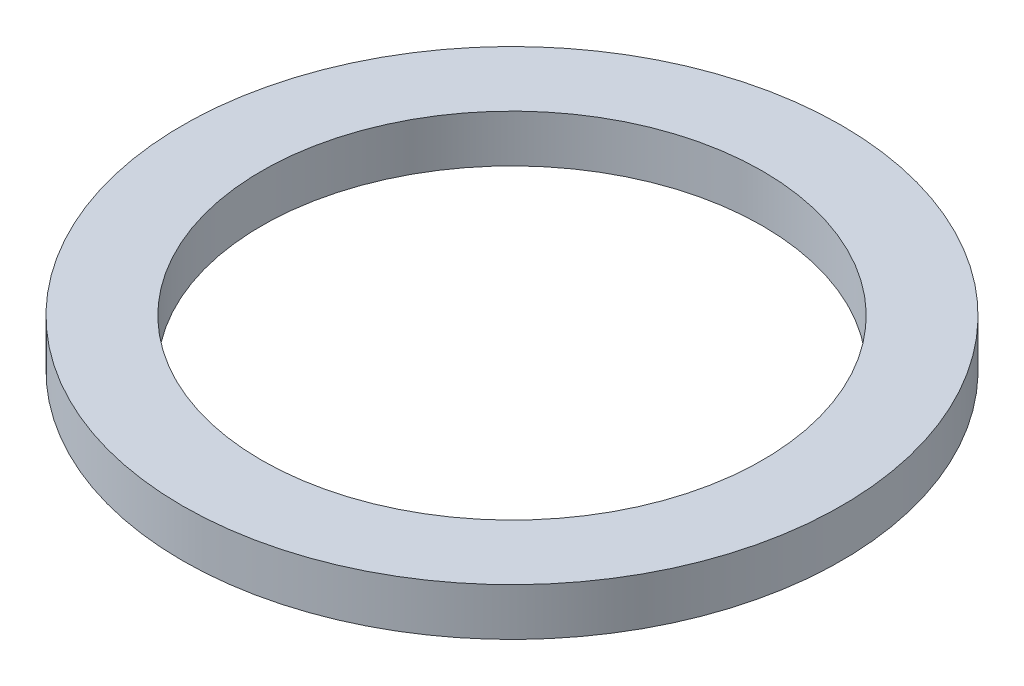
ISO-10303-21;
HEADER;
FILE_DESCRIPTION(('STEP AP214'),'2;1');
FILE_NAME('part.step','',(''),(''),'','','');
FILE_SCHEMA(('AUTOMOTIVE_DESIGN { 1 0 10303 214 1 1 1 1 }'));
ENDSEC;
DATA;
#1=APPLICATION_CONTEXT('core data for automotive mechanical design processes');
#2=APPLICATION_PROTOCOL_DEFINITION('international standard','automotive_design',2000,#1);
#3=PRODUCT_CONTEXT('',#1,'mechanical');
#4=PRODUCT('Part','Part','',(#3));
#5=PRODUCT_RELATED_PRODUCT_CATEGORY('part','',(#4));
#6=PRODUCT_DEFINITION_FORMATION('','',#4);
#7=PRODUCT_DEFINITION_CONTEXT('part definition',#1,'design');
#8=PRODUCT_DEFINITION('design','',#6,#7);
#9=PRODUCT_DEFINITION_SHAPE('','',#8);
#10=(LENGTH_UNIT() NAMED_UNIT(*) SI_UNIT(.MILLI.,.METRE.));
#11=(NAMED_UNIT(*) PLANE_ANGLE_UNIT() SI_UNIT($,.RADIAN.));
#12=(NAMED_UNIT(*) SI_UNIT($,.STERADIAN.) SOLID_ANGLE_UNIT());
#13=UNCERTAINTY_MEASURE_WITH_UNIT(LENGTH_MEASURE(1.E-05),#10,'distance_accuracy_value','');
#14=(GEOMETRIC_REPRESENTATION_CONTEXT(3) GLOBAL_UNCERTAINTY_ASSIGNED_CONTEXT((#13)) GLOBAL_UNIT_ASSIGNED_CONTEXT((#10,
#11,#12)) REPRESENTATION_CONTEXT('',''));
#15=CARTESIAN_POINT('',(0.,0.,0.));
#16=DIRECTION('',(0.,0.,1.));
#17=DIRECTION('',(1.,0.,0.));
#18=AXIS2_PLACEMENT_3D('',#15,#16,#17);
#19=CARTESIAN_POINT('',(0.,9.,0.));
#20=DIRECTION('',(0.,-1.,0.));
#21=DIRECTION('',(0.,0.,-1.));
#22=AXIS2_PLACEMENT_3D('',#19,#20,#21);
#23=CYLINDRICAL_SURFACE('',#22,62.5);
#24=CARTESIAN_POINT('',(0.,9.,0.));
#25=DIRECTION('',(0.,1.,0.));
#26=DIRECTION('',(0.,0.,1.));
#27=AXIS2_PLACEMENT_3D('',#24,#25,#26);
#28=CIRCLE('',#27,62.5);
#29=CARTESIAN_POINT('',(0.,9.,62.5));
#30=VERTEX_POINT('',#29);
#31=EDGE_CURVE('E10',#30,#30,#28,.T.);
#32=ORIENTED_EDGE('',*,*,#31,.F.);
#33=EDGE_LOOP('',(#32));
#34=FACE_BOUND('',#33,.T.);
#35=CARTESIAN_POINT('',(0.,0.,0.));
#36=DIRECTION('',(0.,1.,0.));
#37=DIRECTION('',(0.,0.,1.));
#38=AXIS2_PLACEMENT_3D('',#35,#36,#37);
#39=CIRCLE('',#38,62.5);
#40=CARTESIAN_POINT('',(0.,0.,62.5));
#41=VERTEX_POINT('',#40);
#42=EDGE_CURVE('E37',#41,#41,#39,.T.);
#43=ORIENTED_EDGE('',*,*,#42,.T.);
#44=EDGE_LOOP('',(#43));
#45=FACE_BOUND('',#44,.T.);
#46=ADVANCED_FACE('F40',(#34,#45),#23,.T.);
#47=CARTESIAN_POINT('',(0.,9.,0.));
#48=DIRECTION('',(0.,1.,0.));
#49=DIRECTION('',(0.,0.,1.));
#50=AXIS2_PLACEMENT_3D('',#47,#48,#49);
#51=PLANE('',#50);
#52=CARTESIAN_POINT('',(0.,9.,0.));
#53=DIRECTION('',(0.,1.,0.));
#54=DIRECTION('',(0.,0.,1.));
#55=AXIS2_PLACEMENT_3D('',#52,#53,#54);
#56=CIRCLE('',#55,47.5);
#57=CARTESIAN_POINT('',(0.,9.,47.5));
#58=VERTEX_POINT('',#57);
#59=EDGE_CURVE('E50',#58,#58,#56,.T.);
#60=ORIENTED_EDGE('',*,*,#59,.F.);
#61=EDGE_LOOP('',(#60));
#62=FACE_BOUND('',#61,.T.);
#63=ORIENTED_EDGE('',*,*,#31,.T.);
#64=EDGE_LOOP('',(#63));
#65=FACE_BOUND('',#64,.T.);
#66=ADVANCED_FACE('F59',(#62,#65),#51,.T.);
#67=CARTESIAN_POINT('',(0.,0.,0.));
#68=DIRECTION('',(0.,1.,0.));
#69=DIRECTION('',(0.,0.,1.));
#70=AXIS2_PLACEMENT_3D('',#67,#68,#69);
#71=PLANE('',#70);
#72=CARTESIAN_POINT('',(0.,0.,0.));
#73=DIRECTION('',(0.,1.,0.));
#74=DIRECTION('',(0.,0.,1.));
#75=AXIS2_PLACEMENT_3D('',#72,#73,#74);
#76=CIRCLE('',#75,47.5);
#77=CARTESIAN_POINT('',(0.,0.,47.5));
#78=VERTEX_POINT('',#77);
#79=EDGE_CURVE('E47',#78,#78,#76,.T.);
#80=ORIENTED_EDGE('',*,*,#79,.T.);
#81=EDGE_LOOP('',(#80));
#82=FACE_BOUND('',#81,.T.);
#83=ORIENTED_EDGE('',*,*,#42,.F.);
#84=EDGE_LOOP('',(#83));
#85=FACE_BOUND('',#84,.T.);
#86=ADVANCED_FACE('F58',(#82,#85),#71,.F.);
#87=CARTESIAN_POINT('',(0.,9.,0.));
#88=DIRECTION('',(0.,-1.,0.));
#89=DIRECTION('',(0.,0.,-1.));
#90=AXIS2_PLACEMENT_3D('',#87,#88,#89);
#91=CYLINDRICAL_SURFACE('',#90,47.5);
#92=ORIENTED_EDGE('',*,*,#59,.T.);
#93=EDGE_LOOP('',(#92));
#94=FACE_BOUND('',#93,.T.);
#95=ORIENTED_EDGE('',*,*,#79,.F.);
#96=EDGE_LOOP('',(#95));
#97=FACE_BOUND('',#96,.T.);
#98=ADVANCED_FACE('F54',(#94,#97),#91,.F.);
#99=CLOSED_SHELL('',(#46,#66,#86,#98));
#100=MANIFOLD_SOLID_BREP('B2',#99);
#101=ADVANCED_BREP_SHAPE_REPRESENTATION('',(#18,#100),#14);
#102=SHAPE_DEFINITION_REPRESENTATION(#9,#101);
ENDSEC;
END-ISO-10303-21;
